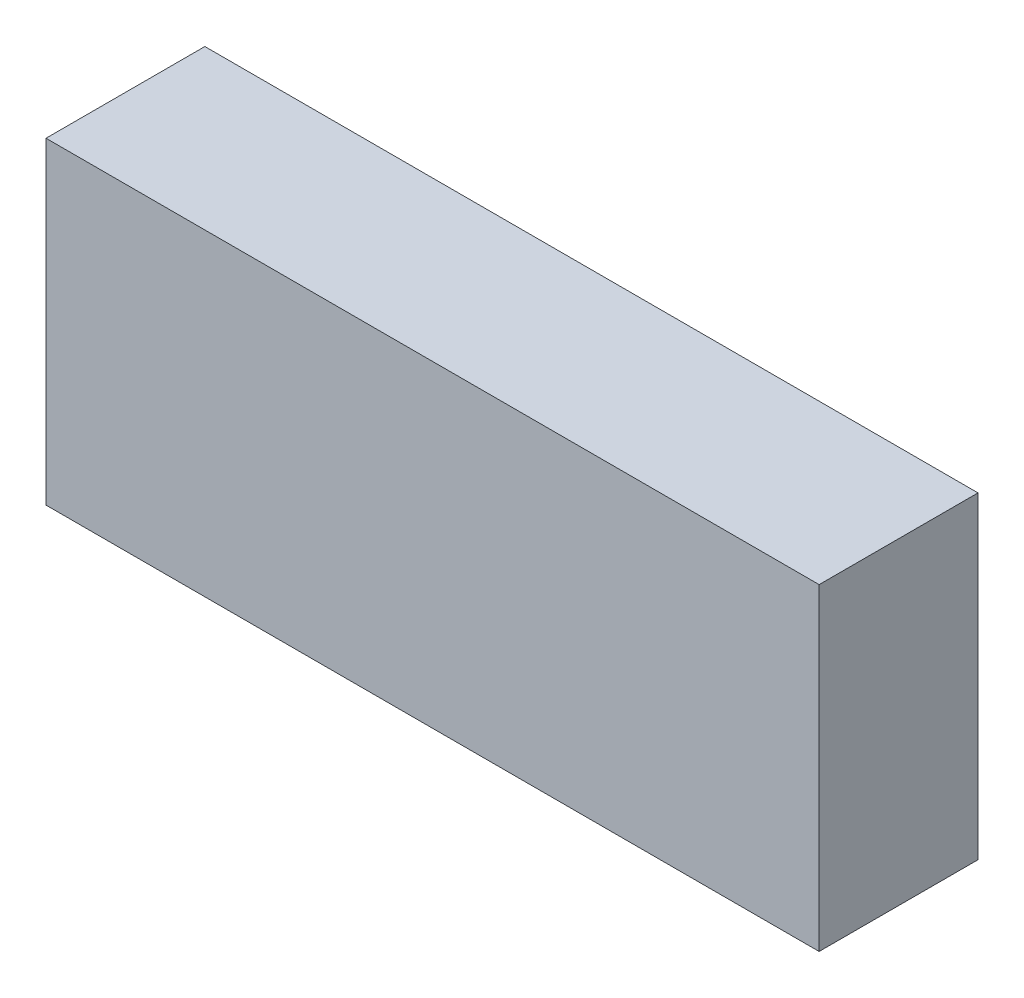
ISO-10303-21;
HEADER;
FILE_DESCRIPTION(('STEP AP214'),'2;1');
FILE_NAME('part.step','',(''),(''),'','','');
FILE_SCHEMA(('AUTOMOTIVE_DESIGN { 1 0 10303 214 1 1 1 1 }'));
ENDSEC;
DATA;
#1=APPLICATION_CONTEXT('core data for automotive mechanical design processes');
#2=APPLICATION_PROTOCOL_DEFINITION('international standard','automotive_design',2000,#1);
#3=PRODUCT_CONTEXT('',#1,'mechanical');
#4=PRODUCT('Part','Part','',(#3));
#5=PRODUCT_RELATED_PRODUCT_CATEGORY('part','',(#4));
#6=PRODUCT_DEFINITION_FORMATION('','',#4);
#7=PRODUCT_DEFINITION_CONTEXT('part definition',#1,'design');
#8=PRODUCT_DEFINITION('design','',#6,#7);
#9=PRODUCT_DEFINITION_SHAPE('','',#8);
#10=(LENGTH_UNIT() NAMED_UNIT(*) SI_UNIT(.MILLI.,.METRE.));
#11=(NAMED_UNIT(*) PLANE_ANGLE_UNIT() SI_UNIT($,.RADIAN.));
#12=(NAMED_UNIT(*) SI_UNIT($,.STERADIAN.) SOLID_ANGLE_UNIT());
#13=UNCERTAINTY_MEASURE_WITH_UNIT(LENGTH_MEASURE(1.E-05),#10,'distance_accuracy_value','');
#14=(GEOMETRIC_REPRESENTATION_CONTEXT(3) GLOBAL_UNCERTAINTY_ASSIGNED_CONTEXT((#13)) GLOBAL_UNIT_ASSIGNED_CONTEXT((#10,
#11,#12)) REPRESENTATION_CONTEXT('',''));
#15=CARTESIAN_POINT('',(0.,0.,0.));
#16=DIRECTION('',(0.,0.,1.));
#17=DIRECTION('',(1.,0.,0.));
#18=AXIS2_PLACEMENT_3D('',#15,#16,#17);
#19=CARTESIAN_POINT('',(0.,0.,15.));
#20=DIRECTION('',(1.,0.,0.));
#21=DIRECTION('',(0.,0.,-1.));
#22=AXIS2_PLACEMENT_3D('',#19,#20,#21);
#23=PLANE('',#22);
#24=DIRECTION('',(0.,-1.,0.));
#25=VECTOR('',#24,1.);
#26=CARTESIAN_POINT('',(0.,0.,0.));
#27=LINE('',#26,#25);
#28=CARTESIAN_POINT('',(0.,30.,0.));
#29=VERTEX_POINT('',#28);
#30=CARTESIAN_POINT('',(0.,0.,0.));
#31=VERTEX_POINT('',#30);
#32=EDGE_CURVE('E107',#29,#31,#27,.T.);
#33=ORIENTED_EDGE('',*,*,#32,.T.);
#34=DIRECTION('',(0.,0.,-1.));
#35=VECTOR('',#34,1.);
#36=CARTESIAN_POINT('',(0.,0.,15.));
#37=LINE('',#36,#35);
#38=CARTESIAN_POINT('',(0.,0.,15.));
#39=VERTEX_POINT('',#38);
#40=EDGE_CURVE('E11',#39,#31,#37,.T.);
#41=ORIENTED_EDGE('',*,*,#40,.F.);
#42=DIRECTION('',(0.,-1.,0.));
#43=VECTOR('',#42,1.);
#44=CARTESIAN_POINT('',(0.,0.,15.));
#45=LINE('',#44,#43);
#46=CARTESIAN_POINT('',(0.,30.,15.));
#47=VERTEX_POINT('',#46);
#48=EDGE_CURVE('E91',#47,#39,#45,.T.);
#49=ORIENTED_EDGE('',*,*,#48,.F.);
#50=DIRECTION('',(0.,0.,-1.));
#51=VECTOR('',#50,1.);
#52=CARTESIAN_POINT('',(0.,30.,15.));
#53=LINE('',#52,#51);
#54=EDGE_CURVE('E103',#47,#29,#53,.T.);
#55=ORIENTED_EDGE('',*,*,#54,.T.);
#56=EDGE_LOOP('',(#33,#41,#49,#55));
#57=FACE_BOUND('',#56,.T.);
#58=ADVANCED_FACE('F39',(#57),#23,.F.);
#59=CARTESIAN_POINT('',(0.,0.,15.));
#60=DIRECTION('',(0.,1.,0.));
#61=DIRECTION('',(0.,0.,1.));
#62=AXIS2_PLACEMENT_3D('',#59,#60,#61);
#63=PLANE('',#62);
#64=DIRECTION('',(1.,0.,0.));
#65=VECTOR('',#64,1.);
#66=CARTESIAN_POINT('',(0.,0.,0.));
#67=LINE('',#66,#65);
#68=CARTESIAN_POINT('',(73.,0.,0.));
#69=VERTEX_POINT('',#68);
#70=EDGE_CURVE('E96',#31,#69,#67,.T.);
#71=ORIENTED_EDGE('',*,*,#70,.T.);
#72=DIRECTION('',(0.,0.,-1.));
#73=VECTOR('',#72,1.);
#74=CARTESIAN_POINT('',(73.,0.,15.));
#75=LINE('',#74,#73);
#76=CARTESIAN_POINT('',(73.,0.,15.));
#77=VERTEX_POINT('',#76);
#78=EDGE_CURVE('E48',#77,#69,#75,.T.);
#79=ORIENTED_EDGE('',*,*,#78,.F.);
#80=DIRECTION('',(1.,0.,0.));
#81=VECTOR('',#80,1.);
#82=CARTESIAN_POINT('',(0.,0.,15.));
#83=LINE('',#82,#81);
#84=EDGE_CURVE('E86',#39,#77,#83,.T.);
#85=ORIENTED_EDGE('',*,*,#84,.F.);
#86=ORIENTED_EDGE('',*,*,#40,.T.);
#87=EDGE_LOOP('',(#71,#79,#85,#86));
#88=FACE_BOUND('',#87,.T.);
#89=ADVANCED_FACE('F95',(#88),#63,.F.);
#90=CARTESIAN_POINT('',(73.,0.,15.));
#91=DIRECTION('',(-1.,0.,0.));
#92=DIRECTION('',(0.,0.,1.));
#93=AXIS2_PLACEMENT_3D('',#90,#91,#92);
#94=PLANE('',#93);
#95=DIRECTION('',(0.,1.,0.));
#96=VECTOR('',#95,1.);
#97=CARTESIAN_POINT('',(73.,0.,0.));
#98=LINE('',#97,#96);
#99=CARTESIAN_POINT('',(73.,30.,0.));
#100=VERTEX_POINT('',#99);
#101=EDGE_CURVE('E73',#69,#100,#98,.T.);
#102=ORIENTED_EDGE('',*,*,#101,.T.);
#103=DIRECTION('',(0.,0.,-1.));
#104=VECTOR('',#103,1.);
#105=CARTESIAN_POINT('',(73.,30.,15.));
#106=LINE('',#105,#104);
#107=CARTESIAN_POINT('',(73.,30.,15.));
#108=VERTEX_POINT('',#107);
#109=EDGE_CURVE('E98',#108,#100,#106,.T.);
#110=ORIENTED_EDGE('',*,*,#109,.F.);
#111=DIRECTION('',(0.,1.,0.));
#112=VECTOR('',#111,1.);
#113=CARTESIAN_POINT('',(73.,0.,15.));
#114=LINE('',#113,#112);
#115=EDGE_CURVE('E89',#77,#108,#114,.T.);
#116=ORIENTED_EDGE('',*,*,#115,.F.);
#117=ORIENTED_EDGE('',*,*,#78,.T.);
#118=EDGE_LOOP('',(#102,#110,#116,#117));
#119=FACE_BOUND('',#118,.T.);
#120=ADVANCED_FACE('F99',(#119),#94,.F.);
#121=CARTESIAN_POINT('',(0.,30.,15.));
#122=DIRECTION('',(0.,-1.,0.));
#123=DIRECTION('',(0.,0.,-1.));
#124=AXIS2_PLACEMENT_3D('',#121,#122,#123);
#125=PLANE('',#124);
#126=DIRECTION('',(-1.,0.,0.));
#127=VECTOR('',#126,1.);
#128=CARTESIAN_POINT('',(0.,30.,0.));
#129=LINE('',#128,#127);
#130=EDGE_CURVE('E79',#100,#29,#129,.T.);
#131=ORIENTED_EDGE('',*,*,#130,.T.);
#132=ORIENTED_EDGE('',*,*,#54,.F.);
#133=DIRECTION('',(-1.,0.,0.));
#134=VECTOR('',#133,1.);
#135=CARTESIAN_POINT('',(0.,30.,15.));
#136=LINE('',#135,#134);
#137=EDGE_CURVE('E56',#108,#47,#136,.T.);
#138=ORIENTED_EDGE('',*,*,#137,.F.);
#139=ORIENTED_EDGE('',*,*,#109,.T.);
#140=EDGE_LOOP('',(#131,#132,#138,#139));
#141=FACE_BOUND('',#140,.T.);
#142=ADVANCED_FACE('F120',(#141),#125,.F.);
#143=CARTESIAN_POINT('',(0.,0.,15.));
#144=DIRECTION('',(0.,0.,-1.));
#145=DIRECTION('',(-1.,0.,0.));
#146=AXIS2_PLACEMENT_3D('',#143,#144,#145);
#147=PLANE('',#146);
#148=ORIENTED_EDGE('',*,*,#48,.T.);
#149=ORIENTED_EDGE('',*,*,#84,.T.);
#150=ORIENTED_EDGE('',*,*,#115,.T.);
#151=ORIENTED_EDGE('',*,*,#137,.T.);
#152=EDGE_LOOP('',(#148,#149,#150,#151));
#153=FACE_BOUND('',#152,.T.);
#154=ADVANCED_FACE('F87',(#153),#147,.F.);
#155=CARTESIAN_POINT('',(0.,0.,0.));
#156=DIRECTION('',(0.,0.,-1.));
#157=DIRECTION('',(-1.,0.,0.));
#158=AXIS2_PLACEMENT_3D('',#155,#156,#157);
#159=PLANE('',#158);
#160=ORIENTED_EDGE('',*,*,#32,.F.);
#161=ORIENTED_EDGE('',*,*,#130,.F.);
#162=ORIENTED_EDGE('',*,*,#101,.F.);
#163=ORIENTED_EDGE('',*,*,#70,.F.);
#164=EDGE_LOOP('',(#160,#161,#162,#163));
#165=FACE_BOUND('',#164,.T.);
#166=ADVANCED_FACE('F123',(#165),#159,.T.);
#167=CLOSED_SHELL('',(#58,#89,#120,#142,#154,#166));
#168=MANIFOLD_SOLID_BREP('B2',#167);
#169=ADVANCED_BREP_SHAPE_REPRESENTATION('',(#18,#168),#14);
#170=SHAPE_DEFINITION_REPRESENTATION(#9,#169);
ENDSEC;
END-ISO-10303-21;
